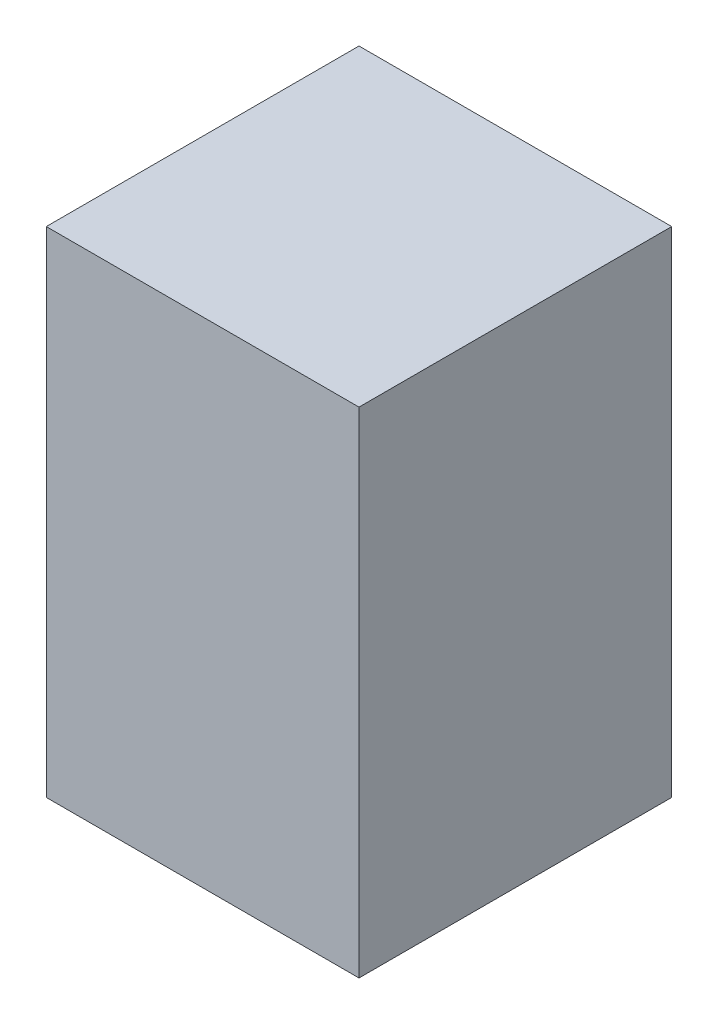
ISO-10303-21;
HEADER;
FILE_DESCRIPTION(('STEP AP214'),'2;1');
FILE_NAME('part.step','',(''),(''),'','','');
FILE_SCHEMA(('AUTOMOTIVE_DESIGN { 1 0 10303 214 1 1 1 1 }'));
ENDSEC;
DATA;
#1=APPLICATION_CONTEXT('core data for automotive mechanical design processes');
#2=APPLICATION_PROTOCOL_DEFINITION('international standard','automotive_design',2000,#1);
#3=PRODUCT_CONTEXT('',#1,'mechanical');
#4=PRODUCT('Part','Part','',(#3));
#5=PRODUCT_RELATED_PRODUCT_CATEGORY('part','',(#4));
#6=PRODUCT_DEFINITION_FORMATION('','',#4);
#7=PRODUCT_DEFINITION_CONTEXT('part definition',#1,'design');
#8=PRODUCT_DEFINITION('design','',#6,#7);
#9=PRODUCT_DEFINITION_SHAPE('','',#8);
#10=(LENGTH_UNIT() NAMED_UNIT(*) SI_UNIT(.MILLI.,.METRE.));
#11=(NAMED_UNIT(*) PLANE_ANGLE_UNIT() SI_UNIT($,.RADIAN.));
#12=(NAMED_UNIT(*) SI_UNIT($,.STERADIAN.) SOLID_ANGLE_UNIT());
#13=UNCERTAINTY_MEASURE_WITH_UNIT(LENGTH_MEASURE(1.E-05),#10,'distance_accuracy_value','');
#14=(GEOMETRIC_REPRESENTATION_CONTEXT(3) GLOBAL_UNCERTAINTY_ASSIGNED_CONTEXT((#13)) GLOBAL_UNIT_ASSIGNED_CONTEXT((#10,
#11,#12)) REPRESENTATION_CONTEXT('',''));
#15=CARTESIAN_POINT('',(0.,0.,0.));
#16=DIRECTION('',(0.,0.,1.));
#17=DIRECTION('',(1.,0.,0.));
#18=AXIS2_PLACEMENT_3D('',#15,#16,#17);
#19=CARTESIAN_POINT('',(-6.325,20.,6.325));
#20=DIRECTION('',(1.,0.,0.));
#21=DIRECTION('',(0.,0.,-1.));
#22=AXIS2_PLACEMENT_3D('',#19,#20,#21);
#23=PLANE('',#22);
#24=DIRECTION('',(0.,0.,1.));
#25=VECTOR('',#24,1.);
#26=CARTESIAN_POINT('',(-6.325,0.,6.325));
#27=LINE('',#26,#25);
#28=CARTESIAN_POINT('',(-6.325,0.,-6.325));
#29=VERTEX_POINT('',#28);
#30=CARTESIAN_POINT('',(-6.325,0.,6.325));
#31=VERTEX_POINT('',#30);
#32=EDGE_CURVE('E96',#29,#31,#27,.T.);
#33=ORIENTED_EDGE('',*,*,#32,.T.);
#34=DIRECTION('',(0.,-1.,0.));
#35=VECTOR('',#34,1.);
#36=CARTESIAN_POINT('',(-6.325,20.,6.325));
#37=LINE('',#36,#35);
#38=CARTESIAN_POINT('',(-6.325,20.,6.325));
#39=VERTEX_POINT('',#38);
#40=EDGE_CURVE('E11',#39,#31,#37,.T.);
#41=ORIENTED_EDGE('',*,*,#40,.F.);
#42=DIRECTION('',(0.,0.,1.));
#43=VECTOR('',#42,1.);
#44=CARTESIAN_POINT('',(-6.325,20.,6.325));
#45=LINE('',#44,#43);
#46=CARTESIAN_POINT('',(-6.325,20.,-6.325));
#47=VERTEX_POINT('',#46);
#48=EDGE_CURVE('E84',#47,#39,#45,.T.);
#49=ORIENTED_EDGE('',*,*,#48,.F.);
#50=DIRECTION('',(0.,-1.,0.));
#51=VECTOR('',#50,1.);
#52=CARTESIAN_POINT('',(-6.325,20.,-6.325));
#53=LINE('',#52,#51);
#54=EDGE_CURVE('E92',#47,#29,#53,.T.);
#55=ORIENTED_EDGE('',*,*,#54,.T.);
#56=EDGE_LOOP('',(#33,#41,#49,#55));
#57=FACE_BOUND('',#56,.T.);
#58=ADVANCED_FACE('F33',(#57),#23,.F.);
#59=CARTESIAN_POINT('',(6.325,20.,6.325));
#60=DIRECTION('',(0.,0.,-1.));
#61=DIRECTION('',(-1.,0.,0.));
#62=AXIS2_PLACEMENT_3D('',#59,#60,#61);
#63=PLANE('',#62);
#64=DIRECTION('',(1.,0.,0.));
#65=VECTOR('',#64,1.);
#66=CARTESIAN_POINT('',(6.325,0.,6.325));
#67=LINE('',#66,#65);
#68=CARTESIAN_POINT('',(6.325,0.,6.325));
#69=VERTEX_POINT('',#68);
#70=EDGE_CURVE('E88',#31,#69,#67,.T.);
#71=ORIENTED_EDGE('',*,*,#70,.T.);
#72=DIRECTION('',(0.,-1.,0.));
#73=VECTOR('',#72,1.);
#74=CARTESIAN_POINT('',(6.325,20.,6.325));
#75=LINE('',#74,#73);
#76=CARTESIAN_POINT('',(6.325,20.,6.325));
#77=VERTEX_POINT('',#76);
#78=EDGE_CURVE('E41',#77,#69,#75,.T.);
#79=ORIENTED_EDGE('',*,*,#78,.F.);
#80=DIRECTION('',(1.,0.,0.));
#81=VECTOR('',#80,1.);
#82=CARTESIAN_POINT('',(6.325,20.,6.325));
#83=LINE('',#82,#81);
#84=EDGE_CURVE('E79',#39,#77,#83,.T.);
#85=ORIENTED_EDGE('',*,*,#84,.F.);
#86=ORIENTED_EDGE('',*,*,#40,.T.);
#87=EDGE_LOOP('',(#71,#79,#85,#86));
#88=FACE_BOUND('',#87,.T.);
#89=ADVANCED_FACE('F87',(#88),#63,.F.);
#90=CARTESIAN_POINT('',(6.325,20.,6.325));
#91=DIRECTION('',(-1.,0.,0.));
#92=DIRECTION('',(0.,0.,1.));
#93=AXIS2_PLACEMENT_3D('',#90,#91,#92);
#94=PLANE('',#93);
#95=DIRECTION('',(0.,0.,-1.));
#96=VECTOR('',#95,1.);
#97=CARTESIAN_POINT('',(6.325,0.,6.325));
#98=LINE('',#97,#96);
#99=CARTESIAN_POINT('',(6.325,0.,-6.325));
#100=VERTEX_POINT('',#99);
#101=EDGE_CURVE('E66',#69,#100,#98,.T.);
#102=ORIENTED_EDGE('',*,*,#101,.T.);
#103=DIRECTION('',(0.,-1.,0.));
#104=VECTOR('',#103,1.);
#105=CARTESIAN_POINT('',(6.325,20.,-6.325));
#106=LINE('',#105,#104);
#107=CARTESIAN_POINT('',(6.325,20.,-6.325));
#108=VERTEX_POINT('',#107);
#109=EDGE_CURVE('E89',#108,#100,#106,.T.);
#110=ORIENTED_EDGE('',*,*,#109,.F.);
#111=DIRECTION('',(0.,0.,-1.));
#112=VECTOR('',#111,1.);
#113=CARTESIAN_POINT('',(6.325,20.,6.325));
#114=LINE('',#113,#112);
#115=EDGE_CURVE('E82',#77,#108,#114,.T.);
#116=ORIENTED_EDGE('',*,*,#115,.F.);
#117=ORIENTED_EDGE('',*,*,#78,.T.);
#118=EDGE_LOOP('',(#102,#110,#116,#117));
#119=FACE_BOUND('',#118,.T.);
#120=ADVANCED_FACE('F90',(#119),#94,.F.);
#121=CARTESIAN_POINT('',(6.325,20.,-6.325));
#122=DIRECTION('',(0.,0.,1.));
#123=DIRECTION('',(1.,0.,0.));
#124=AXIS2_PLACEMENT_3D('',#121,#122,#123);
#125=PLANE('',#124);
#126=DIRECTION('',(-1.,0.,0.));
#127=VECTOR('',#126,1.);
#128=CARTESIAN_POINT('',(6.325,0.,-6.325));
#129=LINE('',#128,#127);
#130=EDGE_CURVE('E72',#100,#29,#129,.T.);
#131=ORIENTED_EDGE('',*,*,#130,.T.);
#132=ORIENTED_EDGE('',*,*,#54,.F.);
#133=DIRECTION('',(-1.,0.,0.));
#134=VECTOR('',#133,1.);
#135=CARTESIAN_POINT('',(6.325,20.,-6.325));
#136=LINE('',#135,#134);
#137=EDGE_CURVE('E49',#108,#47,#136,.T.);
#138=ORIENTED_EDGE('',*,*,#137,.F.);
#139=ORIENTED_EDGE('',*,*,#109,.T.);
#140=EDGE_LOOP('',(#131,#132,#138,#139));
#141=FACE_BOUND('',#140,.T.);
#142=ADVANCED_FACE('F103',(#141),#125,.F.);
#143=CARTESIAN_POINT('',(0.,20.,0.));
#144=DIRECTION('',(0.,1.,0.));
#145=DIRECTION('',(0.,0.,1.));
#146=AXIS2_PLACEMENT_3D('',#143,#144,#145);
#147=PLANE('',#146);
#148=ORIENTED_EDGE('',*,*,#48,.T.);
#149=ORIENTED_EDGE('',*,*,#84,.T.);
#150=ORIENTED_EDGE('',*,*,#115,.T.);
#151=ORIENTED_EDGE('',*,*,#137,.T.);
#152=EDGE_LOOP('',(#148,#149,#150,#151));
#153=FACE_BOUND('',#152,.T.);
#154=ADVANCED_FACE('F80',(#153),#147,.T.);
#155=CARTESIAN_POINT('',(0.,0.,0.));
#156=DIRECTION('',(0.,1.,0.));
#157=DIRECTION('',(0.,0.,1.));
#158=AXIS2_PLACEMENT_3D('',#155,#156,#157);
#159=PLANE('',#158);
#160=ORIENTED_EDGE('',*,*,#32,.F.);
#161=ORIENTED_EDGE('',*,*,#130,.F.);
#162=ORIENTED_EDGE('',*,*,#101,.F.);
#163=ORIENTED_EDGE('',*,*,#70,.F.);
#164=EDGE_LOOP('',(#160,#161,#162,#163));
#165=FACE_BOUND('',#164,.T.);
#166=ADVANCED_FACE('F106',(#165),#159,.F.);
#167=CLOSED_SHELL('',(#58,#89,#120,#142,#154,#166));
#168=MANIFOLD_SOLID_BREP('B2',#167);
#169=ADVANCED_BREP_SHAPE_REPRESENTATION('',(#18,#168),#14);
#170=SHAPE_DEFINITION_REPRESENTATION(#9,#169);
ENDSEC;
END-ISO-10303-21;
